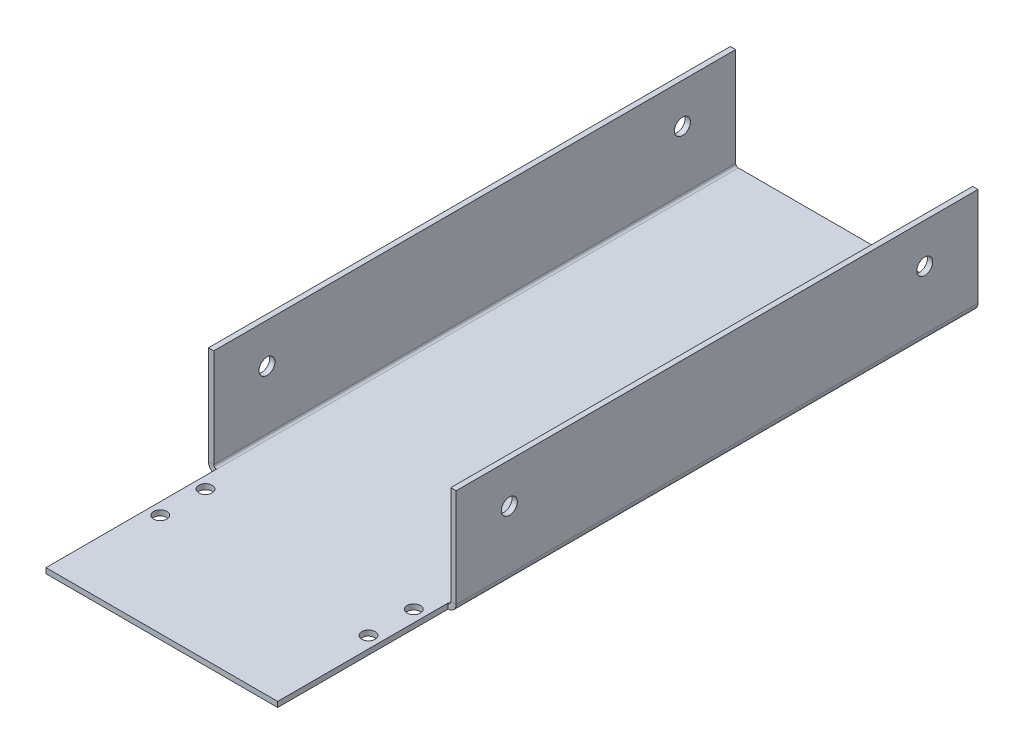
ISO-10303-21;
HEADER;
FILE_DESCRIPTION(('STEP AP214'),'2;1');
FILE_NAME('part.step','',(''),(''),'','','');
FILE_SCHEMA(('AUTOMOTIVE_DESIGN { 1 0 10303 214 1 1 1 1 }'));
ENDSEC;
DATA;
#1=APPLICATION_CONTEXT('core data for automotive mechanical design processes');
#2=APPLICATION_PROTOCOL_DEFINITION('international standard','automotive_design',2000,#1);
#3=PRODUCT_CONTEXT('',#1,'mechanical');
#4=PRODUCT('Part','Part','',(#3));
#5=PRODUCT_RELATED_PRODUCT_CATEGORY('part','',(#4));
#6=PRODUCT_DEFINITION_FORMATION('','',#4);
#7=PRODUCT_DEFINITION_CONTEXT('part definition',#1,'design');
#8=PRODUCT_DEFINITION('design','',#6,#7);
#9=PRODUCT_DEFINITION_SHAPE('','',#8);
#10=(LENGTH_UNIT() NAMED_UNIT(*) SI_UNIT(.MILLI.,.METRE.));
#11=(NAMED_UNIT(*) PLANE_ANGLE_UNIT() SI_UNIT($,.RADIAN.));
#12=(NAMED_UNIT(*) SI_UNIT($,.STERADIAN.) SOLID_ANGLE_UNIT());
#13=UNCERTAINTY_MEASURE_WITH_UNIT(LENGTH_MEASURE(1.E-05),#10,'distance_accuracy_value','');
#14=(GEOMETRIC_REPRESENTATION_CONTEXT(3) GLOBAL_UNCERTAINTY_ASSIGNED_CONTEXT((#13)) GLOBAL_UNIT_ASSIGNED_CONTEXT((#10,
#11,#12)) REPRESENTATION_CONTEXT('',''));
#15=CARTESIAN_POINT('',(0.,0.,0.));
#16=DIRECTION('',(0.,0.,1.));
#17=DIRECTION('',(1.,0.,0.));
#18=AXIS2_PLACEMENT_3D('',#15,#16,#17);
#19=CARTESIAN_POINT('',(-23.25,1.5,49.));
#20=DIRECTION('',(0.,0.,1.));
#21=DIRECTION('',(1.,0.,0.));
#22=AXIS2_PLACEMENT_3D('',#19,#20,#21);
#23=PLANE('',#22);
#24=DIRECTION('',(1.,0.,0.));
#25=VECTOR('',#24,1.);
#26=CARTESIAN_POINT('',(-23.25,1.5,49.));
#27=LINE('',#26,#25);
#28=CARTESIAN_POINT('',(-23.25,1.5,49.));
#29=VERTEX_POINT('',#28);
#30=CARTESIAN_POINT('',(-22.25,1.5,49.));
#31=VERTEX_POINT('',#30);
#32=EDGE_CURVE('E12',#29,#31,#27,.T.);
#33=ORIENTED_EDGE('',*,*,#32,.F.);
#34=CARTESIAN_POINT('',(-21.75,1.5,49.));
#35=DIRECTION('',(0.,0.,-1.));
#36=DIRECTION('',(-1.,0.,0.));
#37=AXIS2_PLACEMENT_3D('',#34,#35,#36);
#38=CIRCLE('',#37,1.5);
#39=CARTESIAN_POINT('',(-21.75,0.,49.));
#40=VERTEX_POINT('',#39);
#41=EDGE_CURVE('E316',#40,#29,#38,.T.);
#42=ORIENTED_EDGE('',*,*,#41,.F.);
#43=DIRECTION('',(0.,-1.,0.));
#44=VECTOR('',#43,1.);
#45=CARTESIAN_POINT('',(-21.75,1.,49.));
#46=LINE('',#45,#44);
#47=CARTESIAN_POINT('',(-21.75,1.,49.));
#48=VERTEX_POINT('',#47);
#49=EDGE_CURVE('E48',#48,#40,#46,.T.);
#50=ORIENTED_EDGE('',*,*,#49,.F.);
#51=CARTESIAN_POINT('',(-21.75,1.5,49.));
#52=DIRECTION('',(0.,0.,1.));
#53=DIRECTION('',(1.,0.,0.));
#54=AXIS2_PLACEMENT_3D('',#51,#52,#53);
#55=CIRCLE('',#54,0.5);
#56=EDGE_CURVE('E176',#48,#31,#55,.F.);
#57=ORIENTED_EDGE('',*,*,#56,.T.);
#58=EDGE_LOOP('',(#33,#42,#50,#57));
#59=FACE_BOUND('',#58,.T.);
#60=ADVANCED_FACE('F39',(#59),#23,.T.);
#61=CARTESIAN_POINT('',(-21.75,1.,49.));
#62=DIRECTION('',(0.,0.,1.));
#63=DIRECTION('',(1.,0.,0.));
#64=AXIS2_PLACEMENT_3D('',#61,#62,#63);
#65=PLANE('',#64);
#66=DIRECTION('',(0.,1.,0.));
#67=VECTOR('',#66,1.);
#68=CARTESIAN_POINT('',(-23.25,20.,49.));
#69=LINE('',#68,#67);
#70=CARTESIAN_POINT('',(-23.25,20.,49.));
#71=VERTEX_POINT('',#70);
#72=EDGE_CURVE('E313',#29,#71,#69,.T.);
#73=ORIENTED_EDGE('',*,*,#72,.F.);
#74=ORIENTED_EDGE('',*,*,#32,.T.);
#75=DIRECTION('',(0.,1.,0.));
#76=VECTOR('',#75,1.);
#77=CARTESIAN_POINT('',(-22.25,20.,49.));
#78=LINE('',#77,#76);
#79=CARTESIAN_POINT('',(-22.25,20.,49.));
#80=VERTEX_POINT('',#79);
#81=EDGE_CURVE('E110',#31,#80,#78,.T.);
#82=ORIENTED_EDGE('',*,*,#81,.T.);
#83=DIRECTION('',(1.,0.,0.));
#84=VECTOR('',#83,1.);
#85=CARTESIAN_POINT('',(-23.25,20.,49.));
#86=LINE('',#85,#84);
#87=EDGE_CURVE('E310',#71,#80,#86,.T.);
#88=ORIENTED_EDGE('',*,*,#87,.F.);
#89=EDGE_LOOP('',(#73,#74,#82,#88));
#90=FACE_BOUND('',#89,.T.);
#91=ADVANCED_FACE('F382',(#90),#65,.T.);
#92=CARTESIAN_POINT('',(-21.75,0.,-49.));
#93=DIRECTION('',(0.,0.,-1.));
#94=DIRECTION('',(-1.,0.,0.));
#95=AXIS2_PLACEMENT_3D('',#92,#93,#94);
#96=PLANE('',#95);
#97=DIRECTION('',(0.,1.,0.));
#98=VECTOR('',#97,1.);
#99=CARTESIAN_POINT('',(-21.75,0.,-49.));
#100=LINE('',#99,#98);
#101=CARTESIAN_POINT('',(-21.75,0.,-49.));
#102=VERTEX_POINT('',#101);
#103=CARTESIAN_POINT('',(-21.75,1.,-49.));
#104=VERTEX_POINT('',#103);
#105=EDGE_CURVE('E97',#102,#104,#100,.T.);
#106=ORIENTED_EDGE('',*,*,#105,.F.);
#107=CARTESIAN_POINT('',(-21.75,1.5,-49.));
#108=DIRECTION('',(0.,0.,-1.));
#109=DIRECTION('',(-1.,0.,0.));
#110=AXIS2_PLACEMENT_3D('',#107,#108,#109);
#111=CIRCLE('',#110,1.5);
#112=CARTESIAN_POINT('',(-23.25,1.5,-49.));
#113=VERTEX_POINT('',#112);
#114=EDGE_CURVE('E192',#102,#113,#111,.T.);
#115=ORIENTED_EDGE('',*,*,#114,.T.);
#116=DIRECTION('',(-1.,0.,0.));
#117=VECTOR('',#116,1.);
#118=CARTESIAN_POINT('',(-22.25,1.5,-49.));
#119=LINE('',#118,#117);
#120=CARTESIAN_POINT('',(-22.25,1.5,-49.));
#121=VERTEX_POINT('',#120);
#122=EDGE_CURVE('E104',#121,#113,#119,.T.);
#123=ORIENTED_EDGE('',*,*,#122,.F.);
#124=CARTESIAN_POINT('',(-21.75,1.5,-49.));
#125=DIRECTION('',(0.,0.,1.));
#126=DIRECTION('',(1.,0.,0.));
#127=AXIS2_PLACEMENT_3D('',#124,#125,#126);
#128=CIRCLE('',#127,0.5);
#129=EDGE_CURVE('E210',#104,#121,#128,.F.);
#130=ORIENTED_EDGE('',*,*,#129,.F.);
#131=EDGE_LOOP('',(#106,#115,#123,#130));
#132=FACE_BOUND('',#131,.T.);
#133=ADVANCED_FACE('F386',(#132),#96,.T.);
#134=CARTESIAN_POINT('',(-22.25,1.5,-49.));
#135=DIRECTION('',(0.,0.,-1.));
#136=DIRECTION('',(-1.,0.,0.));
#137=AXIS2_PLACEMENT_3D('',#134,#135,#136);
#138=PLANE('',#137);
#139=DIRECTION('',(-1.,0.,0.));
#140=VECTOR('',#139,1.);
#141=CARTESIAN_POINT('',(-23.25,0.,-49.));
#142=LINE('',#141,#140);
#143=CARTESIAN_POINT('',(21.75,0.,-49.));
#144=VERTEX_POINT('',#143);
#145=EDGE_CURVE('E194',#144,#102,#142,.T.);
#146=ORIENTED_EDGE('',*,*,#145,.T.);
#147=ORIENTED_EDGE('',*,*,#105,.T.);
#148=DIRECTION('',(1.,0.,0.));
#149=VECTOR('',#148,1.);
#150=CARTESIAN_POINT('',(-23.25,1.,-49.));
#151=LINE('',#150,#149);
#152=CARTESIAN_POINT('',(21.75,1.,-49.));
#153=VERTEX_POINT('',#152);
#154=EDGE_CURVE('E208',#153,#104,#151,.F.);
#155=ORIENTED_EDGE('',*,*,#154,.F.);
#156=DIRECTION('',(0.,-1.,0.));
#157=VECTOR('',#156,1.);
#158=CARTESIAN_POINT('',(21.75,1.,-49.));
#159=LINE('',#158,#157);
#160=EDGE_CURVE('E237',#153,#144,#159,.T.);
#161=ORIENTED_EDGE('',*,*,#160,.T.);
#162=EDGE_LOOP('',(#146,#147,#155,#161));
#163=FACE_BOUND('',#162,.T.);
#164=ADVANCED_FACE('F340',(#163),#138,.T.);
#165=CARTESIAN_POINT('',(21.75,0.,49.));
#166=DIRECTION('',(0.,0.,1.));
#167=DIRECTION('',(1.,0.,0.));
#168=AXIS2_PLACEMENT_3D('',#165,#166,#167);
#169=PLANE('',#168);
#170=DIRECTION('',(0.,1.,0.));
#171=VECTOR('',#170,1.);
#172=CARTESIAN_POINT('',(21.75,0.,49.));
#173=LINE('',#172,#171);
#174=CARTESIAN_POINT('',(21.75,0.,49.));
#175=VERTEX_POINT('',#174);
#176=CARTESIAN_POINT('',(21.75,1.,49.));
#177=VERTEX_POINT('',#176);
#178=EDGE_CURVE('E149',#175,#177,#173,.T.);
#179=ORIENTED_EDGE('',*,*,#178,.F.);
#180=CARTESIAN_POINT('',(21.75,1.5,49.));
#181=DIRECTION('',(0.,0.,-1.));
#182=DIRECTION('',(-1.,0.,0.));
#183=AXIS2_PLACEMENT_3D('',#180,#181,#182);
#184=CIRCLE('',#183,1.5);
#185=CARTESIAN_POINT('',(23.25,1.5,49.));
#186=VERTEX_POINT('',#185);
#187=EDGE_CURVE('E144',#186,#175,#184,.T.);
#188=ORIENTED_EDGE('',*,*,#187,.F.);
#189=DIRECTION('',(1.,0.,0.));
#190=VECTOR('',#189,1.);
#191=CARTESIAN_POINT('',(22.25,1.5,49.));
#192=LINE('',#191,#190);
#193=CARTESIAN_POINT('',(22.25,1.5,49.));
#194=VERTEX_POINT('',#193);
#195=EDGE_CURVE('E137',#194,#186,#192,.T.);
#196=ORIENTED_EDGE('',*,*,#195,.F.);
#197=CARTESIAN_POINT('',(21.75,1.5,49.));
#198=DIRECTION('',(0.,0.,1.));
#199=DIRECTION('',(1.,0.,0.));
#200=AXIS2_PLACEMENT_3D('',#197,#198,#199);
#201=CIRCLE('',#200,0.5);
#202=EDGE_CURVE('E141',#194,#177,#201,.F.);
#203=ORIENTED_EDGE('',*,*,#202,.T.);
#204=EDGE_LOOP('',(#179,#188,#196,#203));
#205=FACE_BOUND('',#204,.T.);
#206=ADVANCED_FACE('F139',(#205),#169,.T.);
#207=CARTESIAN_POINT('',(23.25,1.5,-49.));
#208=DIRECTION('',(0.,0.,-1.));
#209=DIRECTION('',(-1.,0.,0.));
#210=AXIS2_PLACEMENT_3D('',#207,#208,#209);
#211=PLANE('',#210);
#212=DIRECTION('',(-1.,0.,0.));
#213=VECTOR('',#212,1.);
#214=CARTESIAN_POINT('',(23.25,1.5,-49.));
#215=LINE('',#214,#213);
#216=CARTESIAN_POINT('',(23.25,1.5,-49.));
#217=VERTEX_POINT('',#216);
#218=CARTESIAN_POINT('',(22.25,1.5,-49.));
#219=VERTEX_POINT('',#218);
#220=EDGE_CURVE('E150',#217,#219,#215,.T.);
#221=ORIENTED_EDGE('',*,*,#220,.F.);
#222=CARTESIAN_POINT('',(21.75,1.5,-49.));
#223=DIRECTION('',(0.,0.,-1.));
#224=DIRECTION('',(-1.,0.,0.));
#225=AXIS2_PLACEMENT_3D('',#222,#223,#224);
#226=CIRCLE('',#225,1.5);
#227=EDGE_CURVE('E196',#217,#144,#226,.T.);
#228=ORIENTED_EDGE('',*,*,#227,.T.);
#229=ORIENTED_EDGE('',*,*,#160,.F.);
#230=CARTESIAN_POINT('',(21.75,1.5,-49.));
#231=DIRECTION('',(0.,0.,1.));
#232=DIRECTION('',(1.,0.,0.));
#233=AXIS2_PLACEMENT_3D('',#230,#231,#232);
#234=CIRCLE('',#233,0.5);
#235=EDGE_CURVE('E206',#219,#153,#234,.F.);
#236=ORIENTED_EDGE('',*,*,#235,.F.);
#237=EDGE_LOOP('',(#221,#228,#229,#236));
#238=FACE_BOUND('',#237,.T.);
#239=ADVANCED_FACE('F328',(#238),#211,.T.);
#240=CARTESIAN_POINT('',(21.75,1.,-49.));
#241=DIRECTION('',(0.,0.,-1.));
#242=DIRECTION('',(-1.,0.,0.));
#243=AXIS2_PLACEMENT_3D('',#240,#241,#242);
#244=PLANE('',#243);
#245=DIRECTION('',(0.,-1.,0.));
#246=VECTOR('',#245,1.);
#247=CARTESIAN_POINT('',(23.25,20.,-49.));
#248=LINE('',#247,#246);
#249=CARTESIAN_POINT('',(23.25,20.,-49.));
#250=VERTEX_POINT('',#249);
#251=EDGE_CURVE('E199',#250,#217,#248,.T.);
#252=ORIENTED_EDGE('',*,*,#251,.T.);
#253=ORIENTED_EDGE('',*,*,#220,.T.);
#254=DIRECTION('',(0.,-1.,0.));
#255=VECTOR('',#254,1.);
#256=CARTESIAN_POINT('',(22.25,20.,-49.));
#257=LINE('',#256,#255);
#258=CARTESIAN_POINT('',(22.25,20.,-49.));
#259=VERTEX_POINT('',#258);
#260=EDGE_CURVE('E166',#259,#219,#257,.T.);
#261=ORIENTED_EDGE('',*,*,#260,.F.);
#262=DIRECTION('',(1.,0.,0.));
#263=VECTOR('',#262,1.);
#264=CARTESIAN_POINT('',(22.25,20.,-49.));
#265=LINE('',#264,#263);
#266=EDGE_CURVE('E202',#259,#250,#265,.T.);
#267=ORIENTED_EDGE('',*,*,#266,.T.);
#268=EDGE_LOOP('',(#252,#253,#261,#267));
#269=FACE_BOUND('',#268,.T.);
#270=ADVANCED_FACE('F326',(#269),#244,.T.);
#271=CARTESIAN_POINT('',(-22.25,20.,49.));
#272=DIRECTION('',(-1.,0.,0.));
#273=DIRECTION('',(0.,-1.,0.));
#274=AXIS2_PLACEMENT_3D('',#271,#272,#273);
#275=PLANE('',#274);
#276=CARTESIAN_POINT('',(-22.25,12.5,-39.));
#277=DIRECTION('',(-1.,0.,0.));
#278=DIRECTION('',(0.,-1.,0.));
#279=AXIS2_PLACEMENT_3D('',#276,#277,#278);
#280=CIRCLE('',#279,1.5);
#281=CARTESIAN_POINT('',(-22.25,11.,-39.));
#282=VERTEX_POINT('',#281);
#283=EDGE_CURVE('E275',#282,#282,#280,.T.);
#284=ORIENTED_EDGE('',*,*,#283,.T.);
#285=EDGE_LOOP('',(#284));
#286=FACE_BOUND('',#285,.T.);
#287=CARTESIAN_POINT('',(-22.25,12.5,39.));
#288=DIRECTION('',(-1.,0.,0.));
#289=DIRECTION('',(0.,-1.,0.));
#290=AXIS2_PLACEMENT_3D('',#287,#288,#289);
#291=CIRCLE('',#290,1.5);
#292=CARTESIAN_POINT('',(-22.25,11.,39.));
#293=VERTEX_POINT('',#292);
#294=EDGE_CURVE('E263',#293,#293,#291,.T.);
#295=ORIENTED_EDGE('',*,*,#294,.T.);
#296=EDGE_LOOP('',(#295));
#297=FACE_BOUND('',#296,.T.);
#298=DIRECTION('',(0.,1.,0.));
#299=VECTOR('',#298,1.);
#300=CARTESIAN_POINT('',(-22.25,20.,-49.));
#301=LINE('',#300,#299);
#302=CARTESIAN_POINT('',(-22.25,20.,-49.));
#303=VERTEX_POINT('',#302);
#304=EDGE_CURVE('E182',#121,#303,#301,.T.);
#305=ORIENTED_EDGE('',*,*,#304,.T.);
#306=DIRECTION('',(0.,0.,-1.));
#307=VECTOR('',#306,1.);
#308=CARTESIAN_POINT('',(-22.25,20.,49.));
#309=LINE('',#308,#307);
#310=EDGE_CURVE('E235',#80,#303,#309,.T.);
#311=ORIENTED_EDGE('',*,*,#310,.F.);
#312=ORIENTED_EDGE('',*,*,#81,.F.);
#313=DIRECTION('',(0.,0.,-1.));
#314=VECTOR('',#313,1.);
#315=CARTESIAN_POINT('',(-22.25,1.5,49.));
#316=LINE('',#315,#314);
#317=EDGE_CURVE('E178',#31,#121,#316,.T.);
#318=ORIENTED_EDGE('',*,*,#317,.T.);
#319=EDGE_LOOP('',(#305,#311,#312,#318));
#320=FACE_BOUND('',#319,.T.);
#321=ADVANCED_FACE('F400',(#286,#297,#320),#275,.F.);
#322=CARTESIAN_POINT('',(-23.25,20.,49.));
#323=DIRECTION('',(0.,1.,0.));
#324=DIRECTION('',(0.,0.,1.));
#325=AXIS2_PLACEMENT_3D('',#322,#323,#324);
#326=PLANE('',#325);
#327=DIRECTION('',(1.,0.,0.));
#328=VECTOR('',#327,1.);
#329=CARTESIAN_POINT('',(-23.25,20.,-49.));
#330=LINE('',#329,#328);
#331=CARTESIAN_POINT('',(-23.25,20.,-49.));
#332=VERTEX_POINT('',#331);
#333=EDGE_CURVE('E185',#332,#303,#330,.T.);
#334=ORIENTED_EDGE('',*,*,#333,.F.);
#335=DIRECTION('',(0.,0.,-1.));
#336=VECTOR('',#335,1.);
#337=CARTESIAN_POINT('',(-23.25,20.,49.));
#338=LINE('',#337,#336);
#339=EDGE_CURVE('E233',#71,#332,#338,.T.);
#340=ORIENTED_EDGE('',*,*,#339,.F.);
#341=ORIENTED_EDGE('',*,*,#87,.T.);
#342=ORIENTED_EDGE('',*,*,#310,.T.);
#343=EDGE_LOOP('',(#334,#340,#341,#342));
#344=FACE_BOUND('',#343,.T.);
#345=ADVANCED_FACE('F403',(#344),#326,.T.);
#346=CARTESIAN_POINT('',(-23.25,20.,49.));
#347=DIRECTION('',(-1.,0.,0.));
#348=DIRECTION('',(0.,-1.,0.));
#349=AXIS2_PLACEMENT_3D('',#346,#347,#348);
#350=PLANE('',#349);
#351=CARTESIAN_POINT('',(-23.25,12.5,-39.));
#352=DIRECTION('',(-1.,0.,0.));
#353=DIRECTION('',(0.,-1.,0.));
#354=AXIS2_PLACEMENT_3D('',#351,#352,#353);
#355=CIRCLE('',#354,1.5);
#356=CARTESIAN_POINT('',(-23.25,11.,-39.));
#357=VERTEX_POINT('',#356);
#358=EDGE_CURVE('E719',#357,#357,#355,.T.);
#359=ORIENTED_EDGE('',*,*,#358,.F.);
#360=EDGE_LOOP('',(#359));
#361=FACE_BOUND('',#360,.T.);
#362=CARTESIAN_POINT('',(-23.25,12.5,39.));
#363=DIRECTION('',(1.,0.,0.));
#364=DIRECTION('',(0.,0.,-1.));
#365=AXIS2_PLACEMENT_3D('',#362,#363,#364);
#366=CIRCLE('',#365,1.5);
#367=CARTESIAN_POINT('',(-23.25,12.5,37.5));
#368=VERTEX_POINT('',#367);
#369=EDGE_CURVE('E264',#368,#368,#366,.T.);
#370=ORIENTED_EDGE('',*,*,#369,.T.);
#371=EDGE_LOOP('',(#370));
#372=FACE_BOUND('',#371,.T.);
#373=DIRECTION('',(0.,1.,0.));
#374=VECTOR('',#373,1.);
#375=CARTESIAN_POINT('',(-23.25,20.,-49.));
#376=LINE('',#375,#374);
#377=EDGE_CURVE('E189',#113,#332,#376,.T.);
#378=ORIENTED_EDGE('',*,*,#377,.F.);
#379=DIRECTION('',(0.,0.,-1.));
#380=VECTOR('',#379,1.);
#381=CARTESIAN_POINT('',(-23.25,1.5,49.));
#382=LINE('',#381,#380);
#383=EDGE_CURVE('E230',#29,#113,#382,.T.);
#384=ORIENTED_EDGE('',*,*,#383,.F.);
#385=ORIENTED_EDGE('',*,*,#72,.T.);
#386=ORIENTED_EDGE('',*,*,#339,.T.);
#387=EDGE_LOOP('',(#378,#384,#385,#386));
#388=FACE_BOUND('',#387,.T.);
#389=ADVANCED_FACE('F407',(#361,#372,#388),#350,.T.);
#390=CARTESIAN_POINT('',(-21.75,1.5,49.));
#391=DIRECTION('',(0.,0.,-1.));
#392=DIRECTION('',(-1.,0.,0.));
#393=AXIS2_PLACEMENT_3D('',#390,#391,#392);
#394=CYLINDRICAL_SURFACE('',#393,1.5);
#395=ORIENTED_EDGE('',*,*,#114,.F.);
#396=DIRECTION('',(0.,0.,-1.));
#397=VECTOR('',#396,1.);
#398=CARTESIAN_POINT('',(-21.75,0.,49.));
#399=LINE('',#398,#397);
#400=EDGE_CURVE('E227',#40,#102,#399,.T.);
#401=ORIENTED_EDGE('',*,*,#400,.F.);
#402=ORIENTED_EDGE('',*,*,#41,.T.);
#403=ORIENTED_EDGE('',*,*,#383,.T.);
#404=EDGE_LOOP('',(#395,#401,#402,#403));
#405=FACE_BOUND('',#404,.T.);
#406=ADVANCED_FACE('F411',(#405),#394,.T.);
#407=CARTESIAN_POINT('',(-23.25,0.,49.));
#408=DIRECTION('',(0.,-1.,0.));
#409=DIRECTION('',(0.,0.,-1.));
#410=AXIS2_PLACEMENT_3D('',#407,#408,#409);
#411=PLANE('',#410);
#412=CARTESIAN_POINT('',(-19.55,0.,61.75));
#413=DIRECTION('',(0.,-1.,0.));
#414=DIRECTION('',(0.,0.,-1.));
#415=AXIS2_PLACEMENT_3D('',#412,#413,#414);
#416=CIRCLE('',#415,1.25);
#417=CARTESIAN_POINT('',(-19.55,0.,60.5));
#418=VERTEX_POINT('',#417);
#419=EDGE_CURVE('E260',#418,#418,#416,.T.);
#420=ORIENTED_EDGE('',*,*,#419,.F.);
#421=EDGE_LOOP('',(#420));
#422=FACE_BOUND('',#421,.T.);
#423=CARTESIAN_POINT('',(-19.55,0.,53.25));
#424=DIRECTION('',(0.,-1.,0.));
#425=DIRECTION('',(0.,0.,-1.));
#426=AXIS2_PLACEMENT_3D('',#423,#424,#425);
#427=CIRCLE('',#426,1.25);
#428=CARTESIAN_POINT('',(-19.55,0.,52.));
#429=VERTEX_POINT('',#428);
#430=EDGE_CURVE('E257',#429,#429,#427,.T.);
#431=ORIENTED_EDGE('',*,*,#430,.F.);
#432=EDGE_LOOP('',(#431));
#433=FACE_BOUND('',#432,.T.);
#434=CARTESIAN_POINT('',(19.55,0.,61.75));
#435=DIRECTION('',(0.,-1.,0.));
#436=DIRECTION('',(0.,0.,-1.));
#437=AXIS2_PLACEMENT_3D('',#434,#435,#436);
#438=CIRCLE('',#437,1.25);
#439=CARTESIAN_POINT('',(19.55,0.,60.5));
#440=VERTEX_POINT('',#439);
#441=EDGE_CURVE('E253',#440,#440,#438,.T.);
#442=ORIENTED_EDGE('',*,*,#441,.F.);
#443=EDGE_LOOP('',(#442));
#444=FACE_BOUND('',#443,.T.);
#445=CARTESIAN_POINT('',(19.55,0.,53.25));
#446=DIRECTION('',(0.,-1.,0.));
#447=DIRECTION('',(0.,0.,-1.));
#448=AXIS2_PLACEMENT_3D('',#445,#446,#447);
#449=CIRCLE('',#448,1.25);
#450=CARTESIAN_POINT('',(19.55,0.,52.));
#451=VERTEX_POINT('',#450);
#452=EDGE_CURVE('E249',#451,#451,#449,.T.);
#453=ORIENTED_EDGE('',*,*,#452,.F.);
#454=EDGE_LOOP('',(#453));
#455=FACE_BOUND('',#454,.T.);
#456=ORIENTED_EDGE('',*,*,#145,.F.);
#457=DIRECTION('',(0.,0.,-1.));
#458=VECTOR('',#457,1.);
#459=CARTESIAN_POINT('',(21.75,0.,49.));
#460=LINE('',#459,#458);
#461=EDGE_CURVE('E224',#175,#144,#460,.T.);
#462=ORIENTED_EDGE('',*,*,#461,.F.);
#463=DIRECTION('',(0.,0.,-1.));
#464=VECTOR('',#463,1.);
#465=CARTESIAN_POINT('',(21.75,0.,81.));
#466=LINE('',#465,#464);
#467=CARTESIAN_POINT('',(21.75,0.,81.));
#468=VERTEX_POINT('',#467);
#469=EDGE_CURVE('E304',#468,#175,#466,.T.);
#470=ORIENTED_EDGE('',*,*,#469,.F.);
#471=DIRECTION('',(1.,0.,0.));
#472=VECTOR('',#471,1.);
#473=CARTESIAN_POINT('',(-21.75,0.,81.));
#474=LINE('',#473,#472);
#475=CARTESIAN_POINT('',(-21.75,0.,81.));
#476=VERTEX_POINT('',#475);
#477=EDGE_CURVE('E289',#476,#468,#474,.T.);
#478=ORIENTED_EDGE('',*,*,#477,.F.);
#479=DIRECTION('',(0.,0.,-1.));
#480=VECTOR('',#479,1.);
#481=CARTESIAN_POINT('',(-21.75,0.,81.));
#482=LINE('',#481,#480);
#483=EDGE_CURVE('E186',#476,#40,#482,.T.);
#484=ORIENTED_EDGE('',*,*,#483,.T.);
#485=ORIENTED_EDGE('',*,*,#400,.T.);
#486=EDGE_LOOP('',(#456,#462,#470,#478,#484,#485));
#487=FACE_BOUND('',#486,.T.);
#488=ADVANCED_FACE('F338',(#422,#433,#444,#455,#487),#411,.T.);
#489=CARTESIAN_POINT('',(21.75,1.5,49.));
#490=DIRECTION('',(0.,0.,-1.));
#491=DIRECTION('',(-1.,0.,0.));
#492=AXIS2_PLACEMENT_3D('',#489,#490,#491);
#493=CYLINDRICAL_SURFACE('',#492,1.5);
#494=ORIENTED_EDGE('',*,*,#227,.F.);
#495=DIRECTION('',(0.,0.,-1.));
#496=VECTOR('',#495,1.);
#497=CARTESIAN_POINT('',(23.25,1.5,49.));
#498=LINE('',#497,#496);
#499=EDGE_CURVE('E221',#186,#217,#498,.T.);
#500=ORIENTED_EDGE('',*,*,#499,.F.);
#501=ORIENTED_EDGE('',*,*,#187,.T.);
#502=ORIENTED_EDGE('',*,*,#461,.T.);
#503=EDGE_LOOP('',(#494,#500,#501,#502));
#504=FACE_BOUND('',#503,.T.);
#505=ADVANCED_FACE('F333',(#504),#493,.T.);
#506=CARTESIAN_POINT('',(23.25,20.,49.));
#507=DIRECTION('',(1.,0.,0.));
#508=DIRECTION('',(0.,1.,0.));
#509=AXIS2_PLACEMENT_3D('',#506,#507,#508);
#510=PLANE('',#509);
#511=CARTESIAN_POINT('',(23.25,12.5,-39.));
#512=DIRECTION('',(1.,0.,0.));
#513=DIRECTION('',(0.,1.,0.));
#514=AXIS2_PLACEMENT_3D('',#511,#512,#513);
#515=CIRCLE('',#514,1.5);
#516=CARTESIAN_POINT('',(23.25,14.,-39.));
#517=VERTEX_POINT('',#516);
#518=EDGE_CURVE('E724',#517,#517,#515,.T.);
#519=ORIENTED_EDGE('',*,*,#518,.F.);
#520=EDGE_LOOP('',(#519));
#521=FACE_BOUND('',#520,.T.);
#522=CARTESIAN_POINT('',(23.25,12.5,39.));
#523=DIRECTION('',(1.,0.,0.));
#524=DIRECTION('',(0.,0.,-1.));
#525=AXIS2_PLACEMENT_3D('',#522,#523,#524);
#526=CIRCLE('',#525,1.5);
#527=CARTESIAN_POINT('',(23.25,12.5,37.5));
#528=VERTEX_POINT('',#527);
#529=EDGE_CURVE('E270',#528,#528,#526,.T.);
#530=ORIENTED_EDGE('',*,*,#529,.F.);
#531=EDGE_LOOP('',(#530));
#532=FACE_BOUND('',#531,.T.);
#533=ORIENTED_EDGE('',*,*,#251,.F.);
#534=DIRECTION('',(0.,0.,-1.));
#535=VECTOR('',#534,1.);
#536=CARTESIAN_POINT('',(23.25,20.,49.));
#537=LINE('',#536,#535);
#538=CARTESIAN_POINT('',(23.25,20.,49.));
#539=VERTEX_POINT('',#538);
#540=EDGE_CURVE('E219',#539,#250,#537,.T.);
#541=ORIENTED_EDGE('',*,*,#540,.F.);
#542=DIRECTION('',(0.,-1.,0.));
#543=VECTOR('',#542,1.);
#544=CARTESIAN_POINT('',(23.25,20.,49.));
#545=LINE('',#544,#543);
#546=EDGE_CURVE('E320',#539,#186,#545,.T.);
#547=ORIENTED_EDGE('',*,*,#546,.T.);
#548=ORIENTED_EDGE('',*,*,#499,.T.);
#549=EDGE_LOOP('',(#533,#541,#547,#548));
#550=FACE_BOUND('',#549,.T.);
#551=ADVANCED_FACE('F331',(#521,#532,#550),#510,.T.);
#552=CARTESIAN_POINT('',(22.25,20.,49.));
#553=DIRECTION('',(0.,1.,0.));
#554=DIRECTION('',(0.,0.,1.));
#555=AXIS2_PLACEMENT_3D('',#552,#553,#554);
#556=PLANE('',#555);
#557=ORIENTED_EDGE('',*,*,#266,.F.);
#558=DIRECTION('',(0.,0.,-1.));
#559=VECTOR('',#558,1.);
#560=CARTESIAN_POINT('',(22.25,20.,49.));
#561=LINE('',#560,#559);
#562=CARTESIAN_POINT('',(22.25,20.,49.));
#563=VERTEX_POINT('',#562);
#564=EDGE_CURVE('E170',#563,#259,#561,.T.);
#565=ORIENTED_EDGE('',*,*,#564,.F.);
#566=DIRECTION('',(1.,0.,0.));
#567=VECTOR('',#566,1.);
#568=CARTESIAN_POINT('',(22.25,20.,49.));
#569=LINE('',#568,#567);
#570=EDGE_CURVE('E158',#563,#539,#569,.T.);
#571=ORIENTED_EDGE('',*,*,#570,.T.);
#572=ORIENTED_EDGE('',*,*,#540,.T.);
#573=EDGE_LOOP('',(#557,#565,#571,#572));
#574=FACE_BOUND('',#573,.T.);
#575=ADVANCED_FACE('F323',(#574),#556,.T.);
#576=CARTESIAN_POINT('',(22.25,20.,49.));
#577=DIRECTION('',(1.,0.,0.));
#578=DIRECTION('',(0.,1.,0.));
#579=AXIS2_PLACEMENT_3D('',#576,#577,#578);
#580=PLANE('',#579);
#581=CARTESIAN_POINT('',(22.25,12.5,-39.));
#582=DIRECTION('',(1.,0.,0.));
#583=DIRECTION('',(0.,1.,0.));
#584=AXIS2_PLACEMENT_3D('',#581,#582,#583);
#585=CIRCLE('',#584,1.5);
#586=CARTESIAN_POINT('',(22.25,14.,-39.));
#587=VERTEX_POINT('',#586);
#588=EDGE_CURVE('E42',#587,#587,#585,.T.);
#589=ORIENTED_EDGE('',*,*,#588,.T.);
#590=EDGE_LOOP('',(#589));
#591=FACE_BOUND('',#590,.T.);
#592=CARTESIAN_POINT('',(22.25,12.5,39.));
#593=DIRECTION('',(1.,0.,0.));
#594=DIRECTION('',(0.,1.,0.));
#595=AXIS2_PLACEMENT_3D('',#592,#593,#594);
#596=CIRCLE('',#595,1.5);
#597=CARTESIAN_POINT('',(22.25,14.,39.));
#598=VERTEX_POINT('',#597);
#599=EDGE_CURVE('E261',#598,#598,#596,.T.);
#600=ORIENTED_EDGE('',*,*,#599,.T.);
#601=EDGE_LOOP('',(#600));
#602=FACE_BOUND('',#601,.T.);
#603=ORIENTED_EDGE('',*,*,#260,.T.);
#604=DIRECTION('',(0.,0.,-1.));
#605=VECTOR('',#604,1.);
#606=CARTESIAN_POINT('',(22.25,1.5,49.));
#607=LINE('',#606,#605);
#608=EDGE_CURVE('E163',#194,#219,#607,.T.);
#609=ORIENTED_EDGE('',*,*,#608,.F.);
#610=DIRECTION('',(0.,-1.,0.));
#611=VECTOR('',#610,1.);
#612=CARTESIAN_POINT('',(22.25,20.,49.));
#613=LINE('',#612,#611);
#614=EDGE_CURVE('E154',#563,#194,#613,.T.);
#615=ORIENTED_EDGE('',*,*,#614,.F.);
#616=ORIENTED_EDGE('',*,*,#564,.T.);
#617=EDGE_LOOP('',(#603,#609,#615,#616));
#618=FACE_BOUND('',#617,.T.);
#619=ADVANCED_FACE('F164',(#591,#602,#618),#580,.F.);
#620=CARTESIAN_POINT('',(21.75,1.5,49.));
#621=DIRECTION('',(0.,0.,-1.));
#622=DIRECTION('',(-1.,0.,0.));
#623=AXIS2_PLACEMENT_3D('',#620,#621,#622);
#624=CYLINDRICAL_SURFACE('',#623,0.5);
#625=ORIENTED_EDGE('',*,*,#235,.T.);
#626=DIRECTION('',(0.,0.,-1.));
#627=VECTOR('',#626,1.);
#628=CARTESIAN_POINT('',(21.75,1.,49.));
#629=LINE('',#628,#627);
#630=EDGE_CURVE('E171',#177,#153,#629,.T.);
#631=ORIENTED_EDGE('',*,*,#630,.F.);
#632=ORIENTED_EDGE('',*,*,#202,.F.);
#633=ORIENTED_EDGE('',*,*,#608,.T.);
#634=EDGE_LOOP('',(#625,#631,#632,#633));
#635=FACE_BOUND('',#634,.T.);
#636=ADVANCED_FACE('F173',(#635),#624,.F.);
#637=CARTESIAN_POINT('',(-23.25,1.,49.));
#638=DIRECTION('',(0.,-1.,0.));
#639=DIRECTION('',(0.,0.,-1.));
#640=AXIS2_PLACEMENT_3D('',#637,#638,#639);
#641=PLANE('',#640);
#642=CARTESIAN_POINT('',(-19.55,0.999999999999999,61.75));
#643=DIRECTION('',(0.,-1.,0.));
#644=DIRECTION('',(0.,0.,-1.));
#645=AXIS2_PLACEMENT_3D('',#642,#643,#644);
#646=CIRCLE('',#645,1.25);
#647=CARTESIAN_POINT('',(-19.55,0.999999999999999,60.5));
#648=VERTEX_POINT('',#647);
#649=EDGE_CURVE('E258',#648,#648,#646,.T.);
#650=ORIENTED_EDGE('',*,*,#649,.T.);
#651=EDGE_LOOP('',(#650));
#652=FACE_BOUND('',#651,.T.);
#653=CARTESIAN_POINT('',(-19.55,0.999999999999999,53.25));
#654=DIRECTION('',(0.,-1.,0.));
#655=DIRECTION('',(0.,0.,-1.));
#656=AXIS2_PLACEMENT_3D('',#653,#654,#655);
#657=CIRCLE('',#656,1.25);
#658=CARTESIAN_POINT('',(-19.55,0.999999999999999,52.));
#659=VERTEX_POINT('',#658);
#660=EDGE_CURVE('E254',#659,#659,#657,.T.);
#661=ORIENTED_EDGE('',*,*,#660,.T.);
#662=EDGE_LOOP('',(#661));
#663=FACE_BOUND('',#662,.T.);
#664=CARTESIAN_POINT('',(19.55,0.999999999999999,61.75));
#665=DIRECTION('',(0.,-1.,0.));
#666=DIRECTION('',(0.,0.,-1.));
#667=AXIS2_PLACEMENT_3D('',#664,#665,#666);
#668=CIRCLE('',#667,1.25);
#669=CARTESIAN_POINT('',(19.55,0.999999999999999,60.5));
#670=VERTEX_POINT('',#669);
#671=EDGE_CURVE('E250',#670,#670,#668,.T.);
#672=ORIENTED_EDGE('',*,*,#671,.T.);
#673=EDGE_LOOP('',(#672));
#674=FACE_BOUND('',#673,.T.);
#675=CARTESIAN_POINT('',(19.55,0.999999999999999,53.25));
#676=DIRECTION('',(0.,-1.,0.));
#677=DIRECTION('',(0.,0.,-1.));
#678=AXIS2_PLACEMENT_3D('',#675,#676,#677);
#679=CIRCLE('',#678,1.25);
#680=CARTESIAN_POINT('',(19.55,0.999999999999999,52.));
#681=VERTEX_POINT('',#680);
#682=EDGE_CURVE('E245',#681,#681,#679,.T.);
#683=ORIENTED_EDGE('',*,*,#682,.T.);
#684=EDGE_LOOP('',(#683));
#685=FACE_BOUND('',#684,.T.);
#686=ORIENTED_EDGE('',*,*,#154,.T.);
#687=DIRECTION('',(0.,0.,-1.));
#688=VECTOR('',#687,1.);
#689=CARTESIAN_POINT('',(-21.75,1.,49.));
#690=LINE('',#689,#688);
#691=EDGE_CURVE('E214',#48,#104,#690,.T.);
#692=ORIENTED_EDGE('',*,*,#691,.F.);
#693=DIRECTION('',(0.,0.,-1.));
#694=VECTOR('',#693,1.);
#695=CARTESIAN_POINT('',(-21.75,1.,81.));
#696=LINE('',#695,#694);
#697=CARTESIAN_POINT('',(-21.75,1.,81.));
#698=VERTEX_POINT('',#697);
#699=EDGE_CURVE('E298',#698,#48,#696,.T.);
#700=ORIENTED_EDGE('',*,*,#699,.F.);
#701=DIRECTION('',(-1.,0.,0.));
#702=VECTOR('',#701,1.);
#703=CARTESIAN_POINT('',(-21.75,1.,81.));
#704=LINE('',#703,#702);
#705=CARTESIAN_POINT('',(21.75,1.,81.));
#706=VERTEX_POINT('',#705);
#707=EDGE_CURVE('E295',#706,#698,#704,.T.);
#708=ORIENTED_EDGE('',*,*,#707,.F.);
#709=DIRECTION('',(0.,0.,-1.));
#710=VECTOR('',#709,1.);
#711=CARTESIAN_POINT('',(21.75,1.,81.));
#712=LINE('',#711,#710);
#713=EDGE_CURVE('E301',#706,#177,#712,.T.);
#714=ORIENTED_EDGE('',*,*,#713,.T.);
#715=ORIENTED_EDGE('',*,*,#630,.T.);
#716=EDGE_LOOP('',(#686,#692,#700,#708,#714,#715));
#717=FACE_BOUND('',#716,.T.);
#718=ADVANCED_FACE('F342',(#652,#663,#674,#685,#717),#641,.F.);
#719=CARTESIAN_POINT('',(-21.75,1.5,49.));
#720=DIRECTION('',(0.,0.,-1.));
#721=DIRECTION('',(-1.,0.,0.));
#722=AXIS2_PLACEMENT_3D('',#719,#720,#721);
#723=CYLINDRICAL_SURFACE('',#722,0.5);
#724=ORIENTED_EDGE('',*,*,#129,.T.);
#725=ORIENTED_EDGE('',*,*,#317,.F.);
#726=ORIENTED_EDGE('',*,*,#56,.F.);
#727=ORIENTED_EDGE('',*,*,#691,.T.);
#728=EDGE_LOOP('',(#724,#725,#726,#727));
#729=FACE_BOUND('',#728,.T.);
#730=ADVANCED_FACE('F361',(#729),#723,.F.);
#731=CARTESIAN_POINT('',(-21.75,1.5,49.));
#732=DIRECTION('',(0.,0.,-1.));
#733=DIRECTION('',(-1.,0.,0.));
#734=AXIS2_PLACEMENT_3D('',#731,#732,#733);
#735=PLANE('',#734);
#736=ORIENTED_EDGE('',*,*,#614,.T.);
#737=ORIENTED_EDGE('',*,*,#195,.T.);
#738=ORIENTED_EDGE('',*,*,#546,.F.);
#739=ORIENTED_EDGE('',*,*,#570,.F.);
#740=EDGE_LOOP('',(#736,#737,#738,#739));
#741=FACE_BOUND('',#740,.T.);
#742=ADVANCED_FACE('F156',(#741),#735,.F.);
#743=CARTESIAN_POINT('',(-21.75,1.5,-49.));
#744=DIRECTION('',(0.,0.,-1.));
#745=DIRECTION('',(-1.,0.,0.));
#746=AXIS2_PLACEMENT_3D('',#743,#744,#745);
#747=PLANE('',#746);
#748=ORIENTED_EDGE('',*,*,#304,.F.);
#749=ORIENTED_EDGE('',*,*,#122,.T.);
#750=ORIENTED_EDGE('',*,*,#377,.T.);
#751=ORIENTED_EDGE('',*,*,#333,.T.);
#752=EDGE_LOOP('',(#748,#749,#750,#751));
#753=FACE_BOUND('',#752,.T.);
#754=ADVANCED_FACE('F436',(#753),#747,.T.);
#755=CARTESIAN_POINT('',(-21.75,1.,81.));
#756=DIRECTION('',(1.,0.,0.));
#757=DIRECTION('',(0.,0.,-1.));
#758=AXIS2_PLACEMENT_3D('',#755,#756,#757);
#759=PLANE('',#758);
#760=ORIENTED_EDGE('',*,*,#49,.T.);
#761=ORIENTED_EDGE('',*,*,#483,.F.);
#762=DIRECTION('',(0.,-1.,0.));
#763=VECTOR('',#762,1.);
#764=CARTESIAN_POINT('',(-21.75,1.,81.));
#765=LINE('',#764,#763);
#766=EDGE_CURVE('E248',#698,#476,#765,.T.);
#767=ORIENTED_EDGE('',*,*,#766,.F.);
#768=ORIENTED_EDGE('',*,*,#699,.T.);
#769=EDGE_LOOP('',(#760,#761,#767,#768));
#770=FACE_BOUND('',#769,.T.);
#771=ADVANCED_FACE('F368',(#770),#759,.F.);
#772=CARTESIAN_POINT('',(21.75,1.,81.));
#773=DIRECTION('',(-1.,0.,0.));
#774=DIRECTION('',(0.,0.,1.));
#775=AXIS2_PLACEMENT_3D('',#772,#773,#774);
#776=PLANE('',#775);
#777=ORIENTED_EDGE('',*,*,#178,.T.);
#778=ORIENTED_EDGE('',*,*,#713,.F.);
#779=DIRECTION('',(0.,1.,0.));
#780=VECTOR('',#779,1.);
#781=CARTESIAN_POINT('',(21.75,1.,81.));
#782=LINE('',#781,#780);
#783=EDGE_CURVE('E292',#468,#706,#782,.T.);
#784=ORIENTED_EDGE('',*,*,#783,.F.);
#785=ORIENTED_EDGE('',*,*,#469,.T.);
#786=EDGE_LOOP('',(#777,#778,#784,#785));
#787=FACE_BOUND('',#786,.T.);
#788=ADVANCED_FACE('F350',(#787),#776,.F.);
#789=CARTESIAN_POINT('',(0.,0.,81.));
#790=DIRECTION('',(0.,0.,1.));
#791=DIRECTION('',(1.,0.,0.));
#792=AXIS2_PLACEMENT_3D('',#789,#790,#791);
#793=PLANE('',#792);
#794=ORIENTED_EDGE('',*,*,#766,.T.);
#795=ORIENTED_EDGE('',*,*,#477,.T.);
#796=ORIENTED_EDGE('',*,*,#783,.T.);
#797=ORIENTED_EDGE('',*,*,#707,.T.);
#798=EDGE_LOOP('',(#794,#795,#796,#797));
#799=FACE_BOUND('',#798,.T.);
#800=ADVANCED_FACE('F369',(#799),#793,.T.);
#801=CARTESIAN_POINT('',(19.55,10.,53.25));
#802=DIRECTION('',(0.,-1.,0.));
#803=DIRECTION('',(0.,0.,-1.));
#804=AXIS2_PLACEMENT_3D('',#801,#802,#803);
#805=CYLINDRICAL_SURFACE('',#804,1.25);
#806=ORIENTED_EDGE('',*,*,#452,.T.);
#807=EDGE_LOOP('',(#806));
#808=FACE_BOUND('',#807,.T.);
#809=ORIENTED_EDGE('',*,*,#682,.F.);
#810=EDGE_LOOP('',(#809));
#811=FACE_BOUND('',#810,.T.);
#812=ADVANCED_FACE('F371',(#808,#811),#805,.F.);
#813=CARTESIAN_POINT('',(19.55,10.,61.75));
#814=DIRECTION('',(0.,-1.,0.));
#815=DIRECTION('',(0.,0.,-1.));
#816=AXIS2_PLACEMENT_3D('',#813,#814,#815);
#817=CYLINDRICAL_SURFACE('',#816,1.25);
#818=ORIENTED_EDGE('',*,*,#441,.T.);
#819=EDGE_LOOP('',(#818));
#820=FACE_BOUND('',#819,.T.);
#821=ORIENTED_EDGE('',*,*,#671,.F.);
#822=EDGE_LOOP('',(#821));
#823=FACE_BOUND('',#822,.T.);
#824=ADVANCED_FACE('F377',(#820,#823),#817,.F.);
#825=CARTESIAN_POINT('',(-19.55,10.,53.25));
#826=DIRECTION('',(0.,-1.,0.));
#827=DIRECTION('',(0.,0.,-1.));
#828=AXIS2_PLACEMENT_3D('',#825,#826,#827);
#829=CYLINDRICAL_SURFACE('',#828,1.25);
#830=ORIENTED_EDGE('',*,*,#430,.T.);
#831=EDGE_LOOP('',(#830));
#832=FACE_BOUND('',#831,.T.);
#833=ORIENTED_EDGE('',*,*,#660,.F.);
#834=EDGE_LOOP('',(#833));
#835=FACE_BOUND('',#834,.T.);
#836=ADVANCED_FACE('F487',(#832,#835),#829,.F.);
#837=CARTESIAN_POINT('',(-19.55,10.,61.75));
#838=DIRECTION('',(0.,-1.,0.));
#839=DIRECTION('',(0.,0.,-1.));
#840=AXIS2_PLACEMENT_3D('',#837,#838,#839);
#841=CYLINDRICAL_SURFACE('',#840,1.25);
#842=ORIENTED_EDGE('',*,*,#419,.T.);
#843=EDGE_LOOP('',(#842));
#844=FACE_BOUND('',#843,.T.);
#845=ORIENTED_EDGE('',*,*,#649,.F.);
#846=EDGE_LOOP('',(#845));
#847=FACE_BOUND('',#846,.T.);
#848=ADVANCED_FACE('F498',(#844,#847),#841,.F.);
#849=CARTESIAN_POINT('',(-23.25,12.5,39.));
#850=DIRECTION('',(1.,0.,0.));
#851=DIRECTION('',(0.,0.,-1.));
#852=AXIS2_PLACEMENT_3D('',#849,#850,#851);
#853=CYLINDRICAL_SURFACE('',#852,1.5);
#854=ORIENTED_EDGE('',*,*,#529,.T.);
#855=EDGE_LOOP('',(#854));
#856=FACE_BOUND('',#855,.T.);
#857=ORIENTED_EDGE('',*,*,#599,.F.);
#858=EDGE_LOOP('',(#857));
#859=FACE_BOUND('',#858,.T.);
#860=ADVANCED_FACE('F509',(#856,#859),#853,.F.);
#861=ORIENTED_EDGE('',*,*,#369,.F.);
#862=EDGE_LOOP('',(#861));
#863=FACE_BOUND('',#862,.T.);
#864=ORIENTED_EDGE('',*,*,#294,.F.);
#865=EDGE_LOOP('',(#864));
#866=FACE_BOUND('',#865,.T.);
#867=ADVANCED_FACE('F520',(#863,#866),#853,.F.);
#868=CARTESIAN_POINT('',(-46.75,12.5,-39.));
#869=DIRECTION('',(1.,0.,0.));
#870=DIRECTION('',(0.,1.,0.));
#871=AXIS2_PLACEMENT_3D('',#868,#869,#870);
#872=CYLINDRICAL_SURFACE('',#871,1.5);
#873=ORIENTED_EDGE('',*,*,#518,.T.);
#874=EDGE_LOOP('',(#873));
#875=FACE_BOUND('',#874,.T.);
#876=ORIENTED_EDGE('',*,*,#588,.F.);
#877=EDGE_LOOP('',(#876));
#878=FACE_BOUND('',#877,.T.);
#879=ADVANCED_FACE('F531',(#875,#878),#872,.F.);
#880=ORIENTED_EDGE('',*,*,#358,.T.);
#881=EDGE_LOOP('',(#880));
#882=FACE_BOUND('',#881,.T.);
#883=ORIENTED_EDGE('',*,*,#283,.F.);
#884=EDGE_LOOP('',(#883));
#885=FACE_BOUND('',#884,.T.);
#886=ADVANCED_FACE('F575',(#882,#885),#872,.F.);
#887=CLOSED_SHELL('',(#60,#91,#133,#164,#206,#239,#270,#321,#345,#389,#406,#488,#505,#551,#575,
#619,#636,#718,#730,#742,#754,#771,#788,#800,#812,#824,#836,#848,#860,#867,#879,#886));
#888=MANIFOLD_SOLID_BREP('B2',#887);
#889=ADVANCED_BREP_SHAPE_REPRESENTATION('',(#18,#888),#14);
#890=SHAPE_DEFINITION_REPRESENTATION(#9,#889);
ENDSEC;
END-ISO-10303-21;
